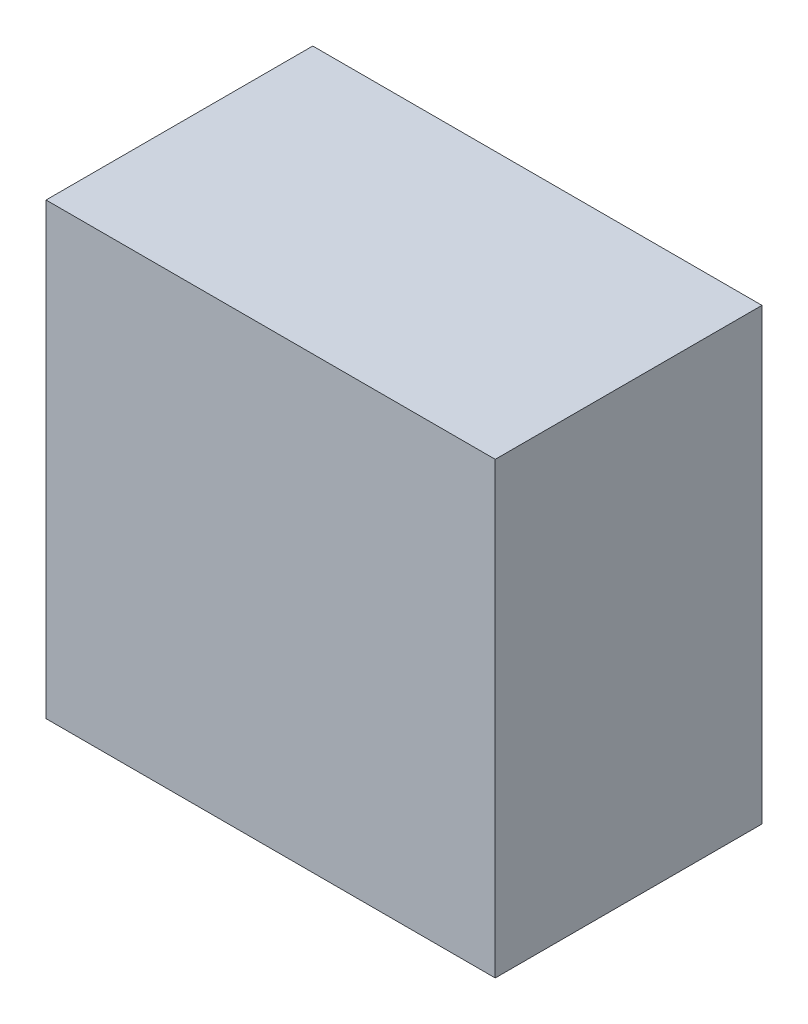
ISO-10303-21;
HEADER;
FILE_DESCRIPTION(('STEP AP214'),'2;1');
FILE_NAME('part.step','',(''),(''),'','','');
FILE_SCHEMA(('AUTOMOTIVE_DESIGN { 1 0 10303 214 1 1 1 1 }'));
ENDSEC;
DATA;
#1=APPLICATION_CONTEXT('core data for automotive mechanical design processes');
#2=APPLICATION_PROTOCOL_DEFINITION('international standard','automotive_design',2000,#1);
#3=PRODUCT_CONTEXT('',#1,'mechanical');
#4=PRODUCT('Part','Part','',(#3));
#5=PRODUCT_RELATED_PRODUCT_CATEGORY('part','',(#4));
#6=PRODUCT_DEFINITION_FORMATION('','',#4);
#7=PRODUCT_DEFINITION_CONTEXT('part definition',#1,'design');
#8=PRODUCT_DEFINITION('design','',#6,#7);
#9=PRODUCT_DEFINITION_SHAPE('','',#8);
#10=(LENGTH_UNIT() NAMED_UNIT(*) SI_UNIT(.MILLI.,.METRE.));
#11=(NAMED_UNIT(*) PLANE_ANGLE_UNIT() SI_UNIT($,.RADIAN.));
#12=(NAMED_UNIT(*) SI_UNIT($,.STERADIAN.) SOLID_ANGLE_UNIT());
#13=UNCERTAINTY_MEASURE_WITH_UNIT(LENGTH_MEASURE(1.E-05),#10,'distance_accuracy_value','');
#14=(GEOMETRIC_REPRESENTATION_CONTEXT(3) GLOBAL_UNCERTAINTY_ASSIGNED_CONTEXT((#13)) GLOBAL_UNIT_ASSIGNED_CONTEXT((#10,
#11,#12)) REPRESENTATION_CONTEXT('',''));
#15=CARTESIAN_POINT('',(0.,0.,0.));
#16=DIRECTION('',(0.,0.,1.));
#17=DIRECTION('',(1.,0.,0.));
#18=AXIS2_PLACEMENT_3D('',#15,#16,#17);
#19=CARTESIAN_POINT('',(-6.096,-6.096,7.239));
#20=DIRECTION('',(0.,0.,1.));
#21=DIRECTION('',(1.,0.,0.));
#22=AXIS2_PLACEMENT_3D('',#19,#20,#21);
#23=PLANE('',#22);
#24=DIRECTION('',(1.,0.,0.));
#25=VECTOR('',#24,1.);
#26=CARTESIAN_POINT('',(-6.096,6.096,7.239));
#27=LINE('',#26,#25);
#28=CARTESIAN_POINT('',(-6.096,6.096,7.239));
#29=VERTEX_POINT('',#28);
#30=CARTESIAN_POINT('',(6.096,6.096,7.239));
#31=VERTEX_POINT('',#30);
#32=EDGE_CURVE('E53',#29,#31,#27,.T.);
#33=ORIENTED_EDGE('',*,*,#32,.F.);
#34=DIRECTION('',(0.,1.,0.));
#35=VECTOR('',#34,1.);
#36=CARTESIAN_POINT('',(-6.096,-6.096,7.239));
#37=LINE('',#36,#35);
#38=CARTESIAN_POINT('',(-6.096,-6.096,7.239));
#39=VERTEX_POINT('',#38);
#40=EDGE_CURVE('E68',#39,#29,#37,.T.);
#41=ORIENTED_EDGE('',*,*,#40,.F.);
#42=DIRECTION('',(1.,0.,0.));
#43=VECTOR('',#42,1.);
#44=CARTESIAN_POINT('',(6.096,-6.096,7.239));
#45=LINE('',#44,#43);
#46=CARTESIAN_POINT('',(6.096,-6.096,7.239));
#47=VERTEX_POINT('',#46);
#48=EDGE_CURVE('E20',#47,#39,#45,.F.);
#49=ORIENTED_EDGE('',*,*,#48,.F.);
#50=DIRECTION('',(0.,1.,0.));
#51=VECTOR('',#50,1.);
#52=CARTESIAN_POINT('',(6.096,6.096,7.239));
#53=LINE('',#52,#51);
#54=EDGE_CURVE('E58',#31,#47,#53,.F.);
#55=ORIENTED_EDGE('',*,*,#54,.F.);
#56=EDGE_LOOP('',(#33,#41,#49,#55));
#57=FACE_BOUND('',#56,.T.);
#58=ADVANCED_FACE('F17',(#57),#23,.T.);
#59=CARTESIAN_POINT('',(6.096,-6.096,0.));
#60=DIRECTION('',(0.,-1.,0.));
#61=DIRECTION('',(0.,0.,-1.));
#62=AXIS2_PLACEMENT_3D('',#59,#60,#61);
#63=PLANE('',#62);
#64=DIRECTION('',(0.,0.,1.));
#65=VECTOR('',#64,1.);
#66=CARTESIAN_POINT('',(-6.096,-6.096,0.));
#67=LINE('',#66,#65);
#68=CARTESIAN_POINT('',(-6.096,-6.096,0.));
#69=VERTEX_POINT('',#68);
#70=EDGE_CURVE('E79',#69,#39,#67,.T.);
#71=ORIENTED_EDGE('',*,*,#70,.F.);
#72=DIRECTION('',(1.,0.,0.));
#73=VECTOR('',#72,1.);
#74=CARTESIAN_POINT('',(-6.096,-6.096,0.));
#75=LINE('',#74,#73);
#76=CARTESIAN_POINT('',(6.096,-6.096,0.));
#77=VERTEX_POINT('',#76);
#78=EDGE_CURVE('E74',#69,#77,#75,.T.);
#79=ORIENTED_EDGE('',*,*,#78,.T.);
#80=DIRECTION('',(0.,0.,-1.));
#81=VECTOR('',#80,1.);
#82=CARTESIAN_POINT('',(6.096,-6.096,0.));
#83=LINE('',#82,#81);
#84=EDGE_CURVE('E63',#47,#77,#83,.T.);
#85=ORIENTED_EDGE('',*,*,#84,.F.);
#86=ORIENTED_EDGE('',*,*,#48,.T.);
#87=EDGE_LOOP('',(#71,#79,#85,#86));
#88=FACE_BOUND('',#87,.T.);
#89=ADVANCED_FACE('F73',(#88),#63,.T.);
#90=CARTESIAN_POINT('',(6.096,6.096,0.));
#91=DIRECTION('',(1.,0.,0.));
#92=DIRECTION('',(0.,0.,-1.));
#93=AXIS2_PLACEMENT_3D('',#90,#91,#92);
#94=PLANE('',#93);
#95=ORIENTED_EDGE('',*,*,#84,.T.);
#96=DIRECTION('',(0.,1.,0.));
#97=VECTOR('',#96,1.);
#98=CARTESIAN_POINT('',(6.096,-6.096,0.));
#99=LINE('',#98,#97);
#100=CARTESIAN_POINT('',(6.096,6.096,0.));
#101=VERTEX_POINT('',#100);
#102=EDGE_CURVE('E84',#77,#101,#99,.T.);
#103=ORIENTED_EDGE('',*,*,#102,.T.);
#104=DIRECTION('',(0.,0.,1.));
#105=VECTOR('',#104,1.);
#106=CARTESIAN_POINT('',(6.096,6.096,0.));
#107=LINE('',#106,#105);
#108=EDGE_CURVE('E65',#31,#101,#107,.F.);
#109=ORIENTED_EDGE('',*,*,#108,.F.);
#110=ORIENTED_EDGE('',*,*,#54,.T.);
#111=EDGE_LOOP('',(#95,#103,#109,#110));
#112=FACE_BOUND('',#111,.T.);
#113=ADVANCED_FACE('F60',(#112),#94,.T.);
#114=CARTESIAN_POINT('',(-6.096,6.096,0.));
#115=DIRECTION('',(0.,1.,0.));
#116=DIRECTION('',(0.,0.,1.));
#117=AXIS2_PLACEMENT_3D('',#114,#115,#116);
#118=PLANE('',#117);
#119=ORIENTED_EDGE('',*,*,#108,.T.);
#120=DIRECTION('',(1.,0.,0.));
#121=VECTOR('',#120,1.);
#122=CARTESIAN_POINT('',(-6.096,6.096,0.));
#123=LINE('',#122,#121);
#124=CARTESIAN_POINT('',(-6.096,6.096,0.));
#125=VERTEX_POINT('',#124);
#126=EDGE_CURVE('E26',#101,#125,#123,.F.);
#127=ORIENTED_EDGE('',*,*,#126,.T.);
#128=DIRECTION('',(0.,0.,1.));
#129=VECTOR('',#128,1.);
#130=CARTESIAN_POINT('',(-6.096,6.096,0.));
#131=LINE('',#130,#129);
#132=EDGE_CURVE('E34',#29,#125,#131,.F.);
#133=ORIENTED_EDGE('',*,*,#132,.F.);
#134=ORIENTED_EDGE('',*,*,#32,.T.);
#135=EDGE_LOOP('',(#119,#127,#133,#134));
#136=FACE_BOUND('',#135,.T.);
#137=ADVANCED_FACE('F88',(#136),#118,.T.);
#138=CARTESIAN_POINT('',(-6.096,-6.096,0.));
#139=DIRECTION('',(-1.,0.,0.));
#140=DIRECTION('',(0.,0.,1.));
#141=AXIS2_PLACEMENT_3D('',#138,#139,#140);
#142=PLANE('',#141);
#143=ORIENTED_EDGE('',*,*,#132,.T.);
#144=DIRECTION('',(0.,1.,0.));
#145=VECTOR('',#144,1.);
#146=CARTESIAN_POINT('',(-6.096,-6.096,0.));
#147=LINE('',#146,#145);
#148=EDGE_CURVE('E11',#125,#69,#147,.F.);
#149=ORIENTED_EDGE('',*,*,#148,.T.);
#150=ORIENTED_EDGE('',*,*,#70,.T.);
#151=ORIENTED_EDGE('',*,*,#40,.T.);
#152=EDGE_LOOP('',(#143,#149,#150,#151));
#153=FACE_BOUND('',#152,.T.);
#154=ADVANCED_FACE('F91',(#153),#142,.T.);
#155=CARTESIAN_POINT('',(-6.096,-6.096,0.));
#156=DIRECTION('',(0.,0.,1.));
#157=DIRECTION('',(1.,0.,0.));
#158=AXIS2_PLACEMENT_3D('',#155,#156,#157);
#159=PLANE('',#158);
#160=ORIENTED_EDGE('',*,*,#126,.F.);
#161=ORIENTED_EDGE('',*,*,#102,.F.);
#162=ORIENTED_EDGE('',*,*,#78,.F.);
#163=ORIENTED_EDGE('',*,*,#148,.F.);
#164=EDGE_LOOP('',(#160,#161,#162,#163));
#165=FACE_BOUND('',#164,.T.);
#166=ADVANCED_FACE('F90',(#165),#159,.F.);
#167=CLOSED_SHELL('',(#58,#89,#113,#137,#154,#166));
#168=MANIFOLD_SOLID_BREP('B1',#167);
#169=ADVANCED_BREP_SHAPE_REPRESENTATION('',(#18,#168),#14);
#170=SHAPE_DEFINITION_REPRESENTATION(#9,#169);
ENDSEC;
END-ISO-10303-21;
